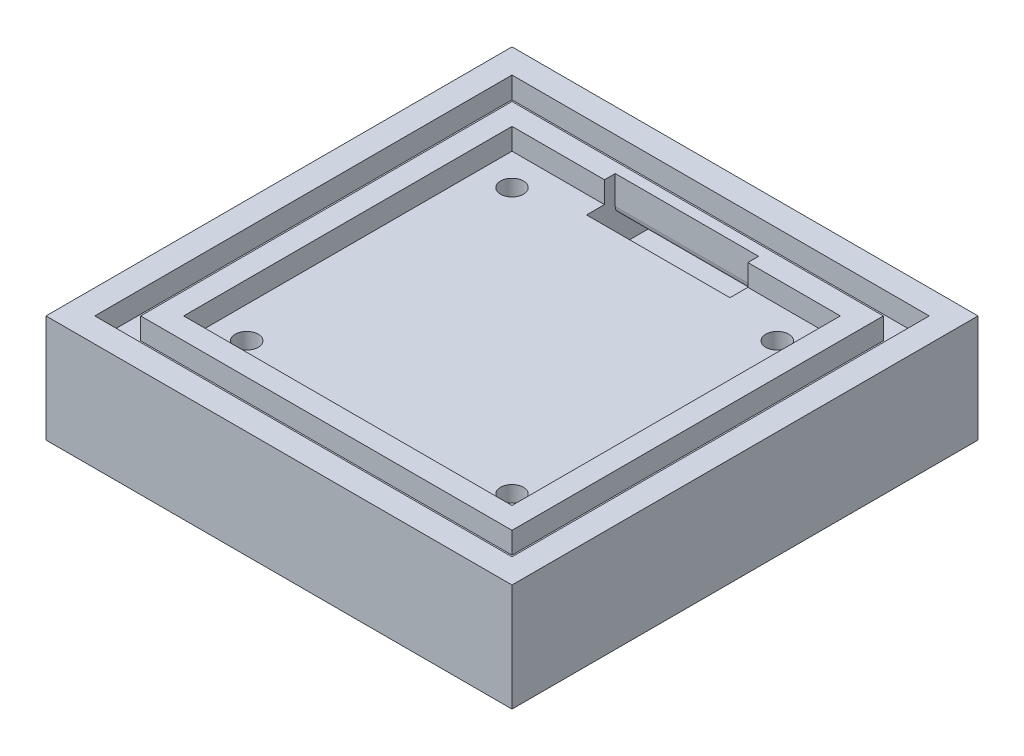
ISO-10303-21;
HEADER;
FILE_DESCRIPTION(('STEP AP214'),'2;1');
FILE_NAME('part.step','',(''),(''),'','','');
FILE_SCHEMA(('AUTOMOTIVE_DESIGN { 1 0 10303 214 1 1 1 1 }'));
ENDSEC;
DATA;
#1=APPLICATION_CONTEXT('core data for automotive mechanical design processes');
#2=APPLICATION_PROTOCOL_DEFINITION('international standard','automotive_design',2000,#1);
#3=PRODUCT_CONTEXT('',#1,'mechanical');
#4=PRODUCT('Part','Part','',(#3));
#5=PRODUCT_RELATED_PRODUCT_CATEGORY('part','',(#4));
#6=PRODUCT_DEFINITION_FORMATION('','',#4);
#7=PRODUCT_DEFINITION_CONTEXT('part definition',#1,'design');
#8=PRODUCT_DEFINITION('design','',#6,#7);
#9=PRODUCT_DEFINITION_SHAPE('','',#8);
#10=(LENGTH_UNIT() NAMED_UNIT(*) SI_UNIT(.MILLI.,.METRE.));
#11=(NAMED_UNIT(*) PLANE_ANGLE_UNIT() SI_UNIT($,.RADIAN.));
#12=(NAMED_UNIT(*) SI_UNIT($,.STERADIAN.) SOLID_ANGLE_UNIT());
#13=UNCERTAINTY_MEASURE_WITH_UNIT(LENGTH_MEASURE(1.E-05),#10,'distance_accuracy_value','');
#14=(GEOMETRIC_REPRESENTATION_CONTEXT(3) GLOBAL_UNCERTAINTY_ASSIGNED_CONTEXT((#13)) GLOBAL_UNIT_ASSIGNED_CONTEXT((#10,
#11,#12)) REPRESENTATION_CONTEXT('',''));
#15=CARTESIAN_POINT('',(0.,0.,0.));
#16=DIRECTION('',(0.,0.,1.));
#17=DIRECTION('',(1.,0.,0.));
#18=AXIS2_PLACEMENT_3D('',#15,#16,#17);
#19=CARTESIAN_POINT('',(9.59999999999999,12.,9.59999999999998));
#20=DIRECTION('',(0.,0.,-1.));
#21=DIRECTION('',(-1.,0.,0.));
#22=AXIS2_PLACEMENT_3D('',#19,#20,#21);
#23=PLANE('',#22);
#24=DIRECTION('',(-1.,0.,0.));
#25=VECTOR('',#24,1.);
#26=CARTESIAN_POINT('',(9.59999999999999,12.,9.59999999999998));
#27=LINE('',#26,#25);
#28=CARTESIAN_POINT('',(22.5,12.,9.59999999999997));
#29=VERTEX_POINT('',#28);
#30=CARTESIAN_POINT('',(9.59999999999999,12.,9.59999999999998));
#31=VERTEX_POINT('',#30);
#32=EDGE_CURVE('E364',#29,#31,#27,.T.);
#33=ORIENTED_EDGE('',*,*,#32,.F.);
#34=DIRECTION('',(0.,1.,0.));
#35=VECTOR('',#34,1.);
#36=CARTESIAN_POINT('',(22.5,12.,9.59999999999997));
#37=LINE('',#36,#35);
#38=CARTESIAN_POINT('',(22.5,15.,9.59999999999996));
#39=VERTEX_POINT('',#38);
#40=EDGE_CURVE('E443',#29,#39,#37,.T.);
#41=ORIENTED_EDGE('',*,*,#40,.T.);
#42=DIRECTION('',(-1.,0.,0.));
#43=VECTOR('',#42,1.);
#44=CARTESIAN_POINT('',(9.59999999999999,15.,9.59999999999998));
#45=LINE('',#44,#43);
#46=CARTESIAN_POINT('',(9.59999999999999,15.,9.59999999999998));
#47=VERTEX_POINT('',#46);
#48=EDGE_CURVE('E376',#39,#47,#45,.T.);
#49=ORIENTED_EDGE('',*,*,#48,.T.);
#50=DIRECTION('',(0.,1.,0.));
#51=VECTOR('',#50,1.);
#52=CARTESIAN_POINT('',(9.59999999999999,12.,9.59999999999998));
#53=LINE('',#52,#51);
#54=EDGE_CURVE('E379',#31,#47,#53,.T.);
#55=ORIENTED_EDGE('',*,*,#54,.F.);
#56=EDGE_LOOP('',(#33,#41,#49,#55));
#57=FACE_BOUND('',#56,.T.);
#58=ADVANCED_FACE('F34',(#57),#23,.F.);
#59=CARTESIAN_POINT('',(14.,15.,51.));
#60=DIRECTION('',(0.,-1.,0.));
#61=DIRECTION('',(0.,0.,-1.));
#62=AXIS2_PLACEMENT_3D('',#59,#60,#61);
#63=CYLINDRICAL_SURFACE('',#62,1.6);
#64=CARTESIAN_POINT('',(14.,12.,51.));
#65=DIRECTION('',(0.,1.,0.));
#66=DIRECTION('',(0.,0.,1.));
#67=AXIS2_PLACEMENT_3D('',#64,#65,#66);
#68=CIRCLE('',#67,1.6);
#69=CARTESIAN_POINT('',(14.,12.,52.6));
#70=VERTEX_POINT('',#69);
#71=EDGE_CURVE('E395',#70,#70,#68,.F.);
#72=ORIENTED_EDGE('',*,*,#71,.F.);
#73=EDGE_LOOP('',(#72));
#74=FACE_BOUND('',#73,.T.);
#75=CARTESIAN_POINT('',(14.,5.,51.));
#76=DIRECTION('',(0.,-1.,0.));
#77=DIRECTION('',(0.,0.,-1.));
#78=AXIS2_PLACEMENT_3D('',#75,#76,#77);
#79=CIRCLE('',#78,1.6);
#80=CARTESIAN_POINT('',(14.,5.,49.4));
#81=VERTEX_POINT('',#80);
#82=EDGE_CURVE('E305',#81,#81,#79,.F.);
#83=ORIENTED_EDGE('',*,*,#82,.F.);
#84=EDGE_LOOP('',(#83));
#85=FACE_BOUND('',#84,.T.);
#86=ADVANCED_FACE('F496',(#74,#85),#63,.F.);
#87=CARTESIAN_POINT('',(51.,15.,14.));
#88=DIRECTION('',(0.,-1.,0.));
#89=DIRECTION('',(0.,0.,-1.));
#90=AXIS2_PLACEMENT_3D('',#87,#88,#89);
#91=CYLINDRICAL_SURFACE('',#90,1.6);
#92=CARTESIAN_POINT('',(51.,12.,14.));
#93=DIRECTION('',(0.,1.,0.));
#94=DIRECTION('',(0.,0.,1.));
#95=AXIS2_PLACEMENT_3D('',#92,#93,#94);
#96=CIRCLE('',#95,1.6);
#97=CARTESIAN_POINT('',(51.,12.,15.6));
#98=VERTEX_POINT('',#97);
#99=EDGE_CURVE('E392',#98,#98,#96,.F.);
#100=ORIENTED_EDGE('',*,*,#99,.F.);
#101=EDGE_LOOP('',(#100));
#102=FACE_BOUND('',#101,.T.);
#103=CARTESIAN_POINT('',(51.,5.,14.));
#104=DIRECTION('',(0.,-1.,0.));
#105=DIRECTION('',(0.,0.,-1.));
#106=AXIS2_PLACEMENT_3D('',#103,#104,#105);
#107=CIRCLE('',#106,1.6);
#108=CARTESIAN_POINT('',(51.,5.,12.4));
#109=VERTEX_POINT('',#108);
#110=EDGE_CURVE('E436',#109,#109,#107,.F.);
#111=ORIENTED_EDGE('',*,*,#110,.F.);
#112=EDGE_LOOP('',(#111));
#113=FACE_BOUND('',#112,.T.);
#114=ADVANCED_FACE('F502',(#102,#113),#91,.F.);
#115=CARTESIAN_POINT('',(14.,15.,14.));
#116=DIRECTION('',(0.,-1.,0.));
#117=DIRECTION('',(0.,0.,-1.));
#118=AXIS2_PLACEMENT_3D('',#115,#116,#117);
#119=CYLINDRICAL_SURFACE('',#118,1.6);
#120=CARTESIAN_POINT('',(14.,12.,14.));
#121=DIRECTION('',(0.,1.,0.));
#122=DIRECTION('',(0.,0.,1.));
#123=AXIS2_PLACEMENT_3D('',#120,#121,#122);
#124=CIRCLE('',#123,1.6);
#125=CARTESIAN_POINT('',(14.,12.,15.6));
#126=VERTEX_POINT('',#125);
#127=EDGE_CURVE('E389',#126,#126,#124,.F.);
#128=ORIENTED_EDGE('',*,*,#127,.F.);
#129=EDGE_LOOP('',(#128));
#130=FACE_BOUND('',#129,.T.);
#131=CARTESIAN_POINT('',(14.,5.,14.));
#132=DIRECTION('',(0.,-1.,0.));
#133=DIRECTION('',(0.,0.,-1.));
#134=AXIS2_PLACEMENT_3D('',#131,#132,#133);
#135=CIRCLE('',#134,1.6);
#136=CARTESIAN_POINT('',(14.,5.,12.4));
#137=VERTEX_POINT('',#136);
#138=EDGE_CURVE('E433',#137,#137,#135,.F.);
#139=ORIENTED_EDGE('',*,*,#138,.F.);
#140=EDGE_LOOP('',(#139));
#141=FACE_BOUND('',#140,.T.);
#142=ADVANCED_FACE('F653',(#130,#141),#119,.F.);
#143=CARTESIAN_POINT('',(51.,15.,51.));
#144=DIRECTION('',(0.,-1.,0.));
#145=DIRECTION('',(0.,0.,-1.));
#146=AXIS2_PLACEMENT_3D('',#143,#144,#145);
#147=CYLINDRICAL_SURFACE('',#146,1.6);
#148=CARTESIAN_POINT('',(51.,12.,51.));
#149=DIRECTION('',(0.,1.,0.));
#150=DIRECTION('',(0.,0.,1.));
#151=AXIS2_PLACEMENT_3D('',#148,#149,#150);
#152=CIRCLE('',#151,1.6);
#153=CARTESIAN_POINT('',(51.,12.,52.6));
#154=VERTEX_POINT('',#153);
#155=EDGE_CURVE('E382',#154,#154,#152,.F.);
#156=ORIENTED_EDGE('',*,*,#155,.F.);
#157=EDGE_LOOP('',(#156));
#158=FACE_BOUND('',#157,.T.);
#159=CARTESIAN_POINT('',(51.,5.,51.));
#160=DIRECTION('',(0.,-1.,0.));
#161=DIRECTION('',(0.,0.,-1.));
#162=AXIS2_PLACEMENT_3D('',#159,#160,#161);
#163=CIRCLE('',#162,1.6);
#164=CARTESIAN_POINT('',(51.,5.,49.4));
#165=VERTEX_POINT('',#164);
#166=EDGE_CURVE('E284',#165,#165,#163,.F.);
#167=ORIENTED_EDGE('',*,*,#166,.F.);
#168=EDGE_LOOP('',(#167));
#169=FACE_BOUND('',#168,.T.);
#170=ADVANCED_FACE('F637',(#158,#169),#147,.F.);
#171=CARTESIAN_POINT('',(0.,15.,0.));
#172=DIRECTION('',(0.,1.,0.));
#173=DIRECTION('',(0.,0.,1.));
#174=AXIS2_PLACEMENT_3D('',#171,#172,#173);
#175=PLANE('',#174);
#176=DIRECTION('',(0.,0.,1.));
#177=VECTOR('',#176,1.);
#178=CARTESIAN_POINT('',(22.5,15.,8.09999999999993));
#179=LINE('',#178,#177);
#180=CARTESIAN_POINT('',(22.5,15.,8.09999999999993));
#181=VERTEX_POINT('',#180);
#182=EDGE_CURVE('E240',#181,#39,#179,.T.);
#183=ORIENTED_EDGE('',*,*,#182,.F.);
#184=DIRECTION('',(-1.,0.,0.));
#185=VECTOR('',#184,1.);
#186=CARTESIAN_POINT('',(22.5,15.,8.09999999999993));
#187=LINE('',#186,#185);
#188=CARTESIAN_POINT('',(42.5,15.,8.09999999999993));
#189=VERTEX_POINT('',#188);
#190=EDGE_CURVE('E218',#189,#181,#187,.T.);
#191=ORIENTED_EDGE('',*,*,#190,.F.);
#192=DIRECTION('',(0.,0.,-1.));
#193=VECTOR('',#192,1.);
#194=CARTESIAN_POINT('',(42.5,15.,8.09999999999993));
#195=LINE('',#194,#193);
#196=CARTESIAN_POINT('',(42.5,15.,9.59999999999996));
#197=VERTEX_POINT('',#196);
#198=EDGE_CURVE('E245',#197,#189,#195,.T.);
#199=ORIENTED_EDGE('',*,*,#198,.F.);
#200=CARTESIAN_POINT('',(55.4,15.,9.59999999999994));
#201=VERTEX_POINT('',#200);
#202=EDGE_CURVE('E358',#201,#197,#45,.T.);
#203=ORIENTED_EDGE('',*,*,#202,.F.);
#204=DIRECTION('',(0.,0.,-1.));
#205=VECTOR('',#204,1.);
#206=CARTESIAN_POINT('',(55.4,15.,9.59999999999994));
#207=LINE('',#206,#205);
#208=CARTESIAN_POINT('',(55.4000000000001,15.,55.3999999999999));
#209=VERTEX_POINT('',#208);
#210=EDGE_CURVE('E373',#209,#201,#207,.T.);
#211=ORIENTED_EDGE('',*,*,#210,.F.);
#212=DIRECTION('',(1.,0.,0.));
#213=VECTOR('',#212,1.);
#214=CARTESIAN_POINT('',(9.60000000000004,15.,55.4));
#215=LINE('',#214,#213);
#216=CARTESIAN_POINT('',(9.60000000000004,15.,55.4));
#217=VERTEX_POINT('',#216);
#218=EDGE_CURVE('E370',#217,#209,#215,.T.);
#219=ORIENTED_EDGE('',*,*,#218,.F.);
#220=DIRECTION('',(0.,0.,1.));
#221=VECTOR('',#220,1.);
#222=CARTESIAN_POINT('',(9.59999999999999,15.,9.59999999999998));
#223=LINE('',#222,#221);
#224=EDGE_CURVE('E347',#47,#217,#223,.T.);
#225=ORIENTED_EDGE('',*,*,#224,.F.);
#226=ORIENTED_EDGE('',*,*,#48,.F.);
#227=EDGE_LOOP('',(#183,#191,#199,#203,#211,#219,#225,#226));
#228=FACE_BOUND('',#227,.T.);
#229=DIRECTION('',(1.,0.,0.));
#230=VECTOR('',#229,1.);
#231=CARTESIAN_POINT('',(58.4000000000001,15.,58.3999999999999));
#232=LINE('',#231,#230);
#233=CARTESIAN_POINT('',(6.60000000000003,15.,58.4));
#234=VERTEX_POINT('',#233);
#235=CARTESIAN_POINT('',(58.4000000000001,15.,58.3999999999999));
#236=VERTEX_POINT('',#235);
#237=EDGE_CURVE('E291',#234,#236,#232,.T.);
#238=ORIENTED_EDGE('',*,*,#237,.T.);
#239=DIRECTION('',(0.,0.,-1.));
#240=VECTOR('',#239,1.);
#241=CARTESIAN_POINT('',(58.4,15.,6.59999999999993));
#242=LINE('',#241,#240);
#243=CARTESIAN_POINT('',(58.4,15.,6.59999999999993));
#244=VERTEX_POINT('',#243);
#245=EDGE_CURVE('E301',#236,#244,#242,.T.);
#246=ORIENTED_EDGE('',*,*,#245,.T.);
#247=DIRECTION('',(-1.,0.,0.));
#248=VECTOR('',#247,1.);
#249=CARTESIAN_POINT('',(58.4,15.,6.59999999999993));
#250=LINE('',#249,#248);
#251=CARTESIAN_POINT('',(6.59999999999997,15.,6.59999999999999));
#252=VERTEX_POINT('',#251);
#253=EDGE_CURVE('E304',#244,#252,#250,.T.);
#254=ORIENTED_EDGE('',*,*,#253,.T.);
#255=DIRECTION('',(0.,0.,1.));
#256=VECTOR('',#255,1.);
#257=CARTESIAN_POINT('',(6.59999999999997,15.,6.59999999999999));
#258=LINE('',#257,#256);
#259=EDGE_CURVE('E308',#252,#234,#258,.T.);
#260=ORIENTED_EDGE('',*,*,#259,.T.);
#261=EDGE_LOOP('',(#238,#246,#254,#260));
#262=FACE_BOUND('',#261,.T.);
#263=ADVANCED_FACE('F471',(#228,#262),#175,.T.);
#264=CARTESIAN_POINT('',(0.,15.,0.));
#265=DIRECTION('',(1.,0.,0.));
#266=DIRECTION('',(0.,0.,-1.));
#267=AXIS2_PLACEMENT_3D('',#264,#265,#266);
#268=PLANE('',#267);
#269=DIRECTION('',(0.,0.,1.));
#270=VECTOR('',#269,1.);
#271=CARTESIAN_POINT('',(0.,0.,0.));
#272=LINE('',#271,#270);
#273=CARTESIAN_POINT('',(0.,0.,0.));
#274=VERTEX_POINT('',#273);
#275=CARTESIAN_POINT('',(0.,0.,65.));
#276=VERTEX_POINT('',#275);
#277=EDGE_CURVE('E398',#274,#276,#272,.T.);
#278=ORIENTED_EDGE('',*,*,#277,.T.);
#279=DIRECTION('',(0.,-1.,0.));
#280=VECTOR('',#279,1.);
#281=CARTESIAN_POINT('',(0.,15.,65.));
#282=LINE('',#281,#280);
#283=CARTESIAN_POINT('',(0.,15.,65.));
#284=VERTEX_POINT('',#283);
#285=EDGE_CURVE('E425',#284,#276,#282,.T.);
#286=ORIENTED_EDGE('',*,*,#285,.F.);
#287=DIRECTION('',(0.,0.,1.));
#288=VECTOR('',#287,1.);
#289=CARTESIAN_POINT('',(0.,15.,0.));
#290=LINE('',#289,#288);
#291=CARTESIAN_POINT('',(0.,15.,0.));
#292=VERTEX_POINT('',#291);
#293=EDGE_CURVE('E399',#292,#284,#290,.T.);
#294=ORIENTED_EDGE('',*,*,#293,.F.);
#295=DIRECTION('',(0.,-1.,0.));
#296=VECTOR('',#295,1.);
#297=CARTESIAN_POINT('',(0.,15.,0.));
#298=LINE('',#297,#296);
#299=EDGE_CURVE('E409',#292,#274,#298,.T.);
#300=ORIENTED_EDGE('',*,*,#299,.T.);
#301=EDGE_LOOP('',(#278,#286,#294,#300));
#302=FACE_BOUND('',#301,.T.);
#303=ADVANCED_FACE('F630',(#302),#268,.F.);
#304=CARTESIAN_POINT('',(0.,15.,65.));
#305=DIRECTION('',(0.,0.,-1.));
#306=DIRECTION('',(-1.,0.,0.));
#307=AXIS2_PLACEMENT_3D('',#304,#305,#306);
#308=PLANE('',#307);
#309=DIRECTION('',(1.,0.,0.));
#310=VECTOR('',#309,1.);
#311=CARTESIAN_POINT('',(0.,0.,65.));
#312=LINE('',#311,#310);
#313=CARTESIAN_POINT('',(65.,0.,65.));
#314=VERTEX_POINT('',#313);
#315=EDGE_CURVE('E412',#276,#314,#312,.T.);
#316=ORIENTED_EDGE('',*,*,#315,.T.);
#317=DIRECTION('',(0.,-1.,0.));
#318=VECTOR('',#317,1.);
#319=CARTESIAN_POINT('',(65.,15.,65.));
#320=LINE('',#319,#318);
#321=CARTESIAN_POINT('',(65.,15.,65.));
#322=VERTEX_POINT('',#321);
#323=EDGE_CURVE('E422',#322,#314,#320,.T.);
#324=ORIENTED_EDGE('',*,*,#323,.F.);
#325=DIRECTION('',(1.,0.,0.));
#326=VECTOR('',#325,1.);
#327=CARTESIAN_POINT('',(0.,15.,65.));
#328=LINE('',#327,#326);
#329=EDGE_CURVE('E402',#284,#322,#328,.T.);
#330=ORIENTED_EDGE('',*,*,#329,.F.);
#331=ORIENTED_EDGE('',*,*,#285,.T.);
#332=EDGE_LOOP('',(#316,#324,#330,#331));
#333=FACE_BOUND('',#332,.T.);
#334=ADVANCED_FACE('F626',(#333),#308,.F.);
#335=CARTESIAN_POINT('',(65.,15.,0.));
#336=DIRECTION('',(-1.,0.,0.));
#337=DIRECTION('',(0.,0.,1.));
#338=AXIS2_PLACEMENT_3D('',#335,#336,#337);
#339=PLANE('',#338);
#340=DIRECTION('',(0.,0.,-1.));
#341=VECTOR('',#340,1.);
#342=CARTESIAN_POINT('',(65.,0.,0.));
#343=LINE('',#342,#341);
#344=CARTESIAN_POINT('',(65.,0.,0.));
#345=VERTEX_POINT('',#344);
#346=EDGE_CURVE('E414',#314,#345,#343,.T.);
#347=ORIENTED_EDGE('',*,*,#346,.T.);
#348=DIRECTION('',(0.,-1.,0.));
#349=VECTOR('',#348,1.);
#350=CARTESIAN_POINT('',(65.,15.,0.));
#351=LINE('',#350,#349);
#352=CARTESIAN_POINT('',(65.,15.,0.));
#353=VERTEX_POINT('',#352);
#354=EDGE_CURVE('E419',#353,#345,#351,.T.);
#355=ORIENTED_EDGE('',*,*,#354,.F.);
#356=DIRECTION('',(0.,0.,-1.));
#357=VECTOR('',#356,1.);
#358=CARTESIAN_POINT('',(65.,15.,0.));
#359=LINE('',#358,#357);
#360=EDGE_CURVE('E405',#322,#353,#359,.T.);
#361=ORIENTED_EDGE('',*,*,#360,.F.);
#362=ORIENTED_EDGE('',*,*,#323,.T.);
#363=EDGE_LOOP('',(#347,#355,#361,#362));
#364=FACE_BOUND('',#363,.T.);
#365=ADVANCED_FACE('F623',(#364),#339,.F.);
#366=CARTESIAN_POINT('',(0.,15.,0.));
#367=DIRECTION('',(0.,0.,1.));
#368=DIRECTION('',(1.,0.,0.));
#369=AXIS2_PLACEMENT_3D('',#366,#367,#368);
#370=PLANE('',#369);
#371=DIRECTION('',(-1.,0.,0.));
#372=VECTOR('',#371,1.);
#373=CARTESIAN_POINT('',(42.5,6.00000000000001,0.));
#374=LINE('',#373,#372);
#375=CARTESIAN_POINT('',(42.5,6.00000000000001,0.));
#376=VERTEX_POINT('',#375);
#377=CARTESIAN_POINT('',(22.5,6.00000000000001,0.));
#378=VERTEX_POINT('',#377);
#379=EDGE_CURVE('E221',#376,#378,#374,.T.);
#380=ORIENTED_EDGE('',*,*,#379,.F.);
#381=DIRECTION('',(0.,-1.,0.));
#382=VECTOR('',#381,1.);
#383=CARTESIAN_POINT('',(42.5,6.00000000000001,0.));
#384=LINE('',#383,#382);
#385=CARTESIAN_POINT('',(42.5,10.,0.));
#386=VERTEX_POINT('',#385);
#387=EDGE_CURVE('E227',#386,#376,#384,.T.);
#388=ORIENTED_EDGE('',*,*,#387,.F.);
#389=DIRECTION('',(1.,0.,0.));
#390=VECTOR('',#389,1.);
#391=CARTESIAN_POINT('',(42.5,10.,0.));
#392=LINE('',#391,#390);
#393=CARTESIAN_POINT('',(22.5,10.,0.));
#394=VERTEX_POINT('',#393);
#395=EDGE_CURVE('E232',#394,#386,#392,.T.);
#396=ORIENTED_EDGE('',*,*,#395,.F.);
#397=DIRECTION('',(0.,1.,0.));
#398=VECTOR('',#397,1.);
#399=CARTESIAN_POINT('',(22.5,6.00000000000001,0.));
#400=LINE('',#399,#398);
#401=EDGE_CURVE('E210',#378,#394,#400,.T.);
#402=ORIENTED_EDGE('',*,*,#401,.F.);
#403=EDGE_LOOP('',(#380,#388,#396,#402));
#404=FACE_BOUND('',#403,.T.);
#405=DIRECTION('',(-1.,0.,0.));
#406=VECTOR('',#405,1.);
#407=CARTESIAN_POINT('',(0.,0.,0.));
#408=LINE('',#407,#406);
#409=EDGE_CURVE('E403',#345,#274,#408,.T.);
#410=ORIENTED_EDGE('',*,*,#409,.T.);
#411=ORIENTED_EDGE('',*,*,#299,.F.);
#412=DIRECTION('',(-1.,0.,0.));
#413=VECTOR('',#412,1.);
#414=CARTESIAN_POINT('',(0.,15.,0.));
#415=LINE('',#414,#413);
#416=EDGE_CURVE('E407',#353,#292,#415,.T.);
#417=ORIENTED_EDGE('',*,*,#416,.F.);
#418=ORIENTED_EDGE('',*,*,#354,.T.);
#419=EDGE_LOOP('',(#410,#411,#417,#418));
#420=FACE_BOUND('',#419,.T.);
#421=ADVANCED_FACE('F229',(#404,#420),#370,.F.);
#422=DIRECTION('',(-1.,0.,0.));
#423=VECTOR('',#422,1.);
#424=CARTESIAN_POINT('',(61.5999999999999,15.,3.40000000000007));
#425=LINE('',#424,#423);
#426=CARTESIAN_POINT('',(61.5999999999999,15.,3.40000000000007));
#427=VERTEX_POINT('',#426);
#428=CARTESIAN_POINT('',(3.40000000000009,15.,3.40000000000008));
#429=VERTEX_POINT('',#428);
#430=EDGE_CURVE('E315',#427,#429,#425,.T.);
#431=ORIENTED_EDGE('',*,*,#430,.F.);
#432=DIRECTION('',(0.,0.,-1.));
#433=VECTOR('',#432,1.);
#434=CARTESIAN_POINT('',(61.5999999999999,15.,3.40000000000007));
#435=LINE('',#434,#433);
#436=CARTESIAN_POINT('',(61.5999999999999,15.,61.5999999999999));
#437=VERTEX_POINT('',#436);
#438=EDGE_CURVE('E326',#437,#427,#435,.T.);
#439=ORIENTED_EDGE('',*,*,#438,.F.);
#440=DIRECTION('',(1.,0.,0.));
#441=VECTOR('',#440,1.);
#442=CARTESIAN_POINT('',(61.5999999999999,15.,61.5999999999999));
#443=LINE('',#442,#441);
#444=CARTESIAN_POINT('',(3.4000000000001,15.,61.5999999999999));
#445=VERTEX_POINT('',#444);
#446=EDGE_CURVE('E340',#445,#437,#443,.T.);
#447=ORIENTED_EDGE('',*,*,#446,.F.);
#448=DIRECTION('',(0.,0.,1.));
#449=VECTOR('',#448,1.);
#450=CARTESIAN_POINT('',(3.40000000000009,15.,3.40000000000008));
#451=LINE('',#450,#449);
#452=EDGE_CURVE('E337',#429,#445,#451,.T.);
#453=ORIENTED_EDGE('',*,*,#452,.F.);
#454=EDGE_LOOP('',(#431,#439,#447,#453));
#455=FACE_BOUND('',#454,.T.);
#456=ORIENTED_EDGE('',*,*,#293,.T.);
#457=ORIENTED_EDGE('',*,*,#329,.T.);
#458=ORIENTED_EDGE('',*,*,#360,.T.);
#459=ORIENTED_EDGE('',*,*,#416,.T.);
#460=EDGE_LOOP('',(#456,#457,#458,#459));
#461=FACE_BOUND('',#460,.T.);
#462=ADVANCED_FACE('F610',(#455,#461),#175,.T.);
#463=CARTESIAN_POINT('',(0.,0.,0.));
#464=DIRECTION('',(0.,1.,0.));
#465=DIRECTION('',(0.,0.,1.));
#466=AXIS2_PLACEMENT_3D('',#463,#464,#465);
#467=PLANE('',#466);
#468=CARTESIAN_POINT('',(14.,0.,51.));
#469=DIRECTION('',(0.,-1.,0.));
#470=DIRECTION('',(0.,0.,-1.));
#471=AXIS2_PLACEMENT_3D('',#468,#469,#470);
#472=CIRCLE('',#471,3.);
#473=CARTESIAN_POINT('',(14.,0.,48.));
#474=VERTEX_POINT('',#473);
#475=EDGE_CURVE('E273',#474,#474,#472,.T.);
#476=ORIENTED_EDGE('',*,*,#475,.F.);
#477=EDGE_LOOP('',(#476));
#478=FACE_BOUND('',#477,.T.);
#479=CARTESIAN_POINT('',(51.,0.,14.));
#480=DIRECTION('',(0.,-1.,0.));
#481=DIRECTION('',(0.,0.,-1.));
#482=AXIS2_PLACEMENT_3D('',#479,#480,#481);
#483=CIRCLE('',#482,3.);
#484=CARTESIAN_POINT('',(51.,0.,11.));
#485=VERTEX_POINT('',#484);
#486=EDGE_CURVE('E266',#485,#485,#483,.T.);
#487=ORIENTED_EDGE('',*,*,#486,.F.);
#488=EDGE_LOOP('',(#487));
#489=FACE_BOUND('',#488,.T.);
#490=CARTESIAN_POINT('',(51.,0.,51.));
#491=DIRECTION('',(0.,-1.,0.));
#492=DIRECTION('',(0.,0.,-1.));
#493=AXIS2_PLACEMENT_3D('',#490,#491,#492);
#494=CIRCLE('',#493,3.);
#495=CARTESIAN_POINT('',(51.,0.,48.));
#496=VERTEX_POINT('',#495);
#497=EDGE_CURVE('E262',#496,#496,#494,.T.);
#498=ORIENTED_EDGE('',*,*,#497,.F.);
#499=EDGE_LOOP('',(#498));
#500=FACE_BOUND('',#499,.T.);
#501=CARTESIAN_POINT('',(14.,0.,14.));
#502=DIRECTION('',(0.,-1.,0.));
#503=DIRECTION('',(0.,0.,-1.));
#504=AXIS2_PLACEMENT_3D('',#501,#502,#503);
#505=CIRCLE('',#504,3.);
#506=CARTESIAN_POINT('',(14.,0.,11.));
#507=VERTEX_POINT('',#506);
#508=EDGE_CURVE('E272',#507,#507,#505,.T.);
#509=ORIENTED_EDGE('',*,*,#508,.F.);
#510=EDGE_LOOP('',(#509));
#511=FACE_BOUND('',#510,.T.);
#512=ORIENTED_EDGE('',*,*,#277,.F.);
#513=ORIENTED_EDGE('',*,*,#409,.F.);
#514=ORIENTED_EDGE('',*,*,#346,.F.);
#515=ORIENTED_EDGE('',*,*,#315,.F.);
#516=EDGE_LOOP('',(#512,#513,#514,#515));
#517=FACE_BOUND('',#516,.T.);
#518=ADVANCED_FACE('F606',(#478,#489,#500,#511,#517),#467,.F.);
#519=CARTESIAN_POINT('',(0.,12.,0.));
#520=DIRECTION('',(0.,1.,0.));
#521=DIRECTION('',(0.,0.,1.));
#522=AXIS2_PLACEMENT_3D('',#519,#520,#521);
#523=PLANE('',#522);
#524=DIRECTION('',(0.,0.,1.));
#525=VECTOR('',#524,1.);
#526=CARTESIAN_POINT('',(22.5,12.,0.));
#527=LINE('',#526,#525);
#528=CARTESIAN_POINT('',(22.5,12.,12.0999999999999));
#529=VERTEX_POINT('',#528);
#530=EDGE_CURVE('E259',#29,#529,#527,.T.);
#531=ORIENTED_EDGE('',*,*,#530,.F.);
#532=ORIENTED_EDGE('',*,*,#32,.T.);
#533=DIRECTION('',(0.,0.,1.));
#534=VECTOR('',#533,1.);
#535=CARTESIAN_POINT('',(9.59999999999999,12.,9.59999999999998));
#536=LINE('',#535,#534);
#537=CARTESIAN_POINT('',(9.60000000000004,12.,55.4));
#538=VERTEX_POINT('',#537);
#539=EDGE_CURVE('E354',#31,#538,#536,.T.);
#540=ORIENTED_EDGE('',*,*,#539,.T.);
#541=DIRECTION('',(1.,0.,0.));
#542=VECTOR('',#541,1.);
#543=CARTESIAN_POINT('',(9.60000000000004,12.,55.4));
#544=LINE('',#543,#542);
#545=CARTESIAN_POINT('',(55.4000000000001,12.,55.3999999999999));
#546=VERTEX_POINT('',#545);
#547=EDGE_CURVE('E357',#538,#546,#544,.T.);
#548=ORIENTED_EDGE('',*,*,#547,.T.);
#549=DIRECTION('',(0.,0.,-1.));
#550=VECTOR('',#549,1.);
#551=CARTESIAN_POINT('',(55.4,12.,9.59999999999994));
#552=LINE('',#551,#550);
#553=CARTESIAN_POINT('',(55.4,12.,9.59999999999994));
#554=VERTEX_POINT('',#553);
#555=EDGE_CURVE('E361',#546,#554,#552,.T.);
#556=ORIENTED_EDGE('',*,*,#555,.T.);
#557=CARTESIAN_POINT('',(42.5,12.,9.59999999999995));
#558=VERTEX_POINT('',#557);
#559=EDGE_CURVE('E365',#554,#558,#27,.T.);
#560=ORIENTED_EDGE('',*,*,#559,.T.);
#561=DIRECTION('',(0.,0.,-1.));
#562=VECTOR('',#561,1.);
#563=CARTESIAN_POINT('',(42.5,12.,0.));
#564=LINE('',#563,#562);
#565=CARTESIAN_POINT('',(42.5,12.,12.0999999999999));
#566=VERTEX_POINT('',#565);
#567=EDGE_CURVE('E252',#566,#558,#564,.T.);
#568=ORIENTED_EDGE('',*,*,#567,.F.);
#569=DIRECTION('',(1.,0.,0.));
#570=VECTOR('',#569,1.);
#571=CARTESIAN_POINT('',(0.,12.,12.0999999999999));
#572=LINE('',#571,#570);
#573=EDGE_CURVE('E446',#529,#566,#572,.T.);
#574=ORIENTED_EDGE('',*,*,#573,.F.);
#575=EDGE_LOOP('',(#531,#532,#540,#548,#556,#560,#568,#574));
#576=FACE_BOUND('',#575,.T.);
#577=ORIENTED_EDGE('',*,*,#155,.T.);
#578=EDGE_LOOP('',(#577));
#579=FACE_BOUND('',#578,.T.);
#580=ORIENTED_EDGE('',*,*,#127,.T.);
#581=EDGE_LOOP('',(#580));
#582=FACE_BOUND('',#581,.T.);
#583=ORIENTED_EDGE('',*,*,#99,.T.);
#584=EDGE_LOOP('',(#583));
#585=FACE_BOUND('',#584,.T.);
#586=ORIENTED_EDGE('',*,*,#71,.T.);
#587=EDGE_LOOP('',(#586));
#588=FACE_BOUND('',#587,.T.);
#589=ADVANCED_FACE('F481',(#576,#579,#582,#585,#588),#523,.T.);
#590=CARTESIAN_POINT('',(9.59999999999999,12.,9.59999999999998));
#591=DIRECTION('',(-1.,0.,0.));
#592=DIRECTION('',(0.,0.,1.));
#593=AXIS2_PLACEMENT_3D('',#590,#591,#592);
#594=PLANE('',#593);
#595=ORIENTED_EDGE('',*,*,#224,.T.);
#596=DIRECTION('',(0.,1.,0.));
#597=VECTOR('',#596,1.);
#598=CARTESIAN_POINT('',(9.60000000000004,12.,55.4));
#599=LINE('',#598,#597);
#600=EDGE_CURVE('E368',#538,#217,#599,.T.);
#601=ORIENTED_EDGE('',*,*,#600,.F.);
#602=ORIENTED_EDGE('',*,*,#539,.F.);
#603=ORIENTED_EDGE('',*,*,#54,.T.);
#604=EDGE_LOOP('',(#595,#601,#602,#603));
#605=FACE_BOUND('',#604,.T.);
#606=ADVANCED_FACE('F509',(#605),#594,.F.);
#607=ORIENTED_EDGE('',*,*,#202,.T.);
#608=DIRECTION('',(0.,-1.,0.));
#609=VECTOR('',#608,1.);
#610=CARTESIAN_POINT('',(42.5,12.,9.59999999999995));
#611=LINE('',#610,#609);
#612=EDGE_CURVE('E428',#197,#558,#611,.T.);
#613=ORIENTED_EDGE('',*,*,#612,.T.);
#614=ORIENTED_EDGE('',*,*,#559,.F.);
#615=DIRECTION('',(0.,1.,0.));
#616=VECTOR('',#615,1.);
#617=CARTESIAN_POINT('',(55.4,12.,9.59999999999994));
#618=LINE('',#617,#616);
#619=EDGE_CURVE('E383',#554,#201,#618,.T.);
#620=ORIENTED_EDGE('',*,*,#619,.T.);
#621=EDGE_LOOP('',(#607,#613,#614,#620));
#622=FACE_BOUND('',#621,.T.);
#623=ADVANCED_FACE('F498',(#622),#23,.F.);
#624=CARTESIAN_POINT('',(55.4,12.,9.59999999999994));
#625=DIRECTION('',(1.,0.,0.));
#626=DIRECTION('',(0.,0.,-1.));
#627=AXIS2_PLACEMENT_3D('',#624,#625,#626);
#628=PLANE('',#627);
#629=ORIENTED_EDGE('',*,*,#210,.T.);
#630=ORIENTED_EDGE('',*,*,#619,.F.);
#631=ORIENTED_EDGE('',*,*,#555,.F.);
#632=DIRECTION('',(0.,1.,0.));
#633=VECTOR('',#632,1.);
#634=CARTESIAN_POINT('',(55.4000000000001,12.,55.3999999999999));
#635=LINE('',#634,#633);
#636=EDGE_CURVE('E385',#546,#209,#635,.T.);
#637=ORIENTED_EDGE('',*,*,#636,.T.);
#638=EDGE_LOOP('',(#629,#630,#631,#637));
#639=FACE_BOUND('',#638,.T.);
#640=ADVANCED_FACE('F508',(#639),#628,.F.);
#641=CARTESIAN_POINT('',(9.60000000000004,12.,55.4));
#642=DIRECTION('',(0.,0.,1.));
#643=DIRECTION('',(1.,0.,0.));
#644=AXIS2_PLACEMENT_3D('',#641,#642,#643);
#645=PLANE('',#644);
#646=ORIENTED_EDGE('',*,*,#218,.T.);
#647=ORIENTED_EDGE('',*,*,#636,.F.);
#648=ORIENTED_EDGE('',*,*,#547,.F.);
#649=ORIENTED_EDGE('',*,*,#600,.T.);
#650=EDGE_LOOP('',(#646,#647,#648,#649));
#651=FACE_BOUND('',#650,.T.);
#652=ADVANCED_FACE('F515',(#651),#645,.F.);
#653=CARTESIAN_POINT('',(61.5999999999999,12.,3.40000000000007));
#654=DIRECTION('',(0.,0.,-1.));
#655=DIRECTION('',(-1.,0.,0.));
#656=AXIS2_PLACEMENT_3D('',#653,#654,#655);
#657=PLANE('',#656);
#658=ORIENTED_EDGE('',*,*,#430,.T.);
#659=DIRECTION('',(0.,1.,0.));
#660=VECTOR('',#659,1.);
#661=CARTESIAN_POINT('',(3.40000000000009,12.,3.40000000000008));
#662=LINE('',#661,#660);
#663=CARTESIAN_POINT('',(3.40000000000009,12.,3.40000000000008));
#664=VERTEX_POINT('',#663);
#665=EDGE_CURVE('E335',#664,#429,#662,.T.);
#666=ORIENTED_EDGE('',*,*,#665,.F.);
#667=DIRECTION('',(-1.,0.,0.));
#668=VECTOR('',#667,1.);
#669=CARTESIAN_POINT('',(61.5999999999999,12.,3.40000000000007));
#670=LINE('',#669,#668);
#671=CARTESIAN_POINT('',(61.5999999999999,12.,3.40000000000007));
#672=VERTEX_POINT('',#671);
#673=EDGE_CURVE('E322',#672,#664,#670,.T.);
#674=ORIENTED_EDGE('',*,*,#673,.F.);
#675=DIRECTION('',(0.,1.,0.));
#676=VECTOR('',#675,1.);
#677=CARTESIAN_POINT('',(61.5999999999999,12.,3.40000000000007));
#678=LINE('',#677,#676);
#679=EDGE_CURVE('E345',#672,#427,#678,.T.);
#680=ORIENTED_EDGE('',*,*,#679,.T.);
#681=EDGE_LOOP('',(#658,#666,#674,#680));
#682=FACE_BOUND('',#681,.T.);
#683=ADVANCED_FACE('F595',(#682),#657,.F.);
#684=CARTESIAN_POINT('',(61.5999999999999,12.,3.40000000000007));
#685=DIRECTION('',(1.,0.,0.));
#686=DIRECTION('',(0.,0.,-1.));
#687=AXIS2_PLACEMENT_3D('',#684,#685,#686);
#688=PLANE('',#687);
#689=ORIENTED_EDGE('',*,*,#438,.T.);
#690=ORIENTED_EDGE('',*,*,#679,.F.);
#691=DIRECTION('',(0.,0.,-1.));
#692=VECTOR('',#691,1.);
#693=CARTESIAN_POINT('',(61.5999999999999,12.,3.40000000000007));
#694=LINE('',#693,#692);
#695=CARTESIAN_POINT('',(61.5999999999999,12.,61.5999999999999));
#696=VERTEX_POINT('',#695);
#697=EDGE_CURVE('E332',#696,#672,#694,.T.);
#698=ORIENTED_EDGE('',*,*,#697,.F.);
#699=DIRECTION('',(0.,1.,0.));
#700=VECTOR('',#699,1.);
#701=CARTESIAN_POINT('',(61.5999999999999,12.,61.5999999999999));
#702=LINE('',#701,#700);
#703=EDGE_CURVE('E348',#696,#437,#702,.T.);
#704=ORIENTED_EDGE('',*,*,#703,.T.);
#705=EDGE_LOOP('',(#689,#690,#698,#704));
#706=FACE_BOUND('',#705,.T.);
#707=ADVANCED_FACE('F591',(#706),#688,.F.);
#708=CARTESIAN_POINT('',(61.5999999999999,12.,61.5999999999999));
#709=DIRECTION('',(0.,0.,1.));
#710=DIRECTION('',(1.,0.,0.));
#711=AXIS2_PLACEMENT_3D('',#708,#709,#710);
#712=PLANE('',#711);
#713=ORIENTED_EDGE('',*,*,#446,.T.);
#714=ORIENTED_EDGE('',*,*,#703,.F.);
#715=DIRECTION('',(1.,0.,0.));
#716=VECTOR('',#715,1.);
#717=CARTESIAN_POINT('',(61.5999999999999,12.,61.5999999999999));
#718=LINE('',#717,#716);
#719=CARTESIAN_POINT('',(3.4000000000001,12.,61.5999999999999));
#720=VERTEX_POINT('',#719);
#721=EDGE_CURVE('E329',#720,#696,#718,.T.);
#722=ORIENTED_EDGE('',*,*,#721,.F.);
#723=DIRECTION('',(0.,1.,0.));
#724=VECTOR('',#723,1.);
#725=CARTESIAN_POINT('',(3.4000000000001,12.,61.5999999999999));
#726=LINE('',#725,#724);
#727=EDGE_CURVE('E350',#720,#445,#726,.T.);
#728=ORIENTED_EDGE('',*,*,#727,.T.);
#729=EDGE_LOOP('',(#713,#714,#722,#728));
#730=FACE_BOUND('',#729,.T.);
#731=ADVANCED_FACE('F594',(#730),#712,.F.);
#732=CARTESIAN_POINT('',(3.40000000000009,12.,3.40000000000008));
#733=DIRECTION('',(-1.,0.,0.));
#734=DIRECTION('',(0.,0.,1.));
#735=AXIS2_PLACEMENT_3D('',#732,#733,#734);
#736=PLANE('',#735);
#737=ORIENTED_EDGE('',*,*,#452,.T.);
#738=ORIENTED_EDGE('',*,*,#727,.F.);
#739=DIRECTION('',(0.,0.,1.));
#740=VECTOR('',#739,1.);
#741=CARTESIAN_POINT('',(3.40000000000009,12.,3.40000000000008));
#742=LINE('',#741,#740);
#743=EDGE_CURVE('E325',#664,#720,#742,.T.);
#744=ORIENTED_EDGE('',*,*,#743,.F.);
#745=ORIENTED_EDGE('',*,*,#665,.T.);
#746=EDGE_LOOP('',(#737,#738,#744,#745));
#747=FACE_BOUND('',#746,.T.);
#748=ADVANCED_FACE('F589',(#747),#736,.F.);
#749=CARTESIAN_POINT('',(0.,12.,0.));
#750=DIRECTION('',(0.,1.,0.));
#751=DIRECTION('',(0.,0.,1.));
#752=AXIS2_PLACEMENT_3D('',#749,#750,#751);
#753=PLANE('',#752);
#754=DIRECTION('',(1.,0.,0.));
#755=VECTOR('',#754,1.);
#756=CARTESIAN_POINT('',(58.4000000000001,12.,58.3999999999999));
#757=LINE('',#756,#755);
#758=CARTESIAN_POINT('',(6.60000000000003,12.,58.4));
#759=VERTEX_POINT('',#758);
#760=CARTESIAN_POINT('',(58.4000000000001,12.,58.3999999999999));
#761=VERTEX_POINT('',#760);
#762=EDGE_CURVE('E297',#759,#761,#757,.T.);
#763=ORIENTED_EDGE('',*,*,#762,.F.);
#764=DIRECTION('',(0.,0.,1.));
#765=VECTOR('',#764,1.);
#766=CARTESIAN_POINT('',(6.59999999999997,12.,6.59999999999999));
#767=LINE('',#766,#765);
#768=CARTESIAN_POINT('',(6.59999999999997,12.,6.59999999999999));
#769=VERTEX_POINT('',#768);
#770=EDGE_CURVE('E294',#769,#759,#767,.T.);
#771=ORIENTED_EDGE('',*,*,#770,.F.);
#772=DIRECTION('',(-1.,0.,0.));
#773=VECTOR('',#772,1.);
#774=CARTESIAN_POINT('',(58.4,12.,6.59999999999993));
#775=LINE('',#774,#773);
#776=CARTESIAN_POINT('',(58.4,12.,6.59999999999993));
#777=VERTEX_POINT('',#776);
#778=EDGE_CURVE('E290',#777,#769,#775,.T.);
#779=ORIENTED_EDGE('',*,*,#778,.F.);
#780=DIRECTION('',(0.,0.,-1.));
#781=VECTOR('',#780,1.);
#782=CARTESIAN_POINT('',(58.4,12.,6.59999999999993));
#783=LINE('',#782,#781);
#784=EDGE_CURVE('E287',#761,#777,#783,.T.);
#785=ORIENTED_EDGE('',*,*,#784,.F.);
#786=EDGE_LOOP('',(#763,#771,#779,#785));
#787=FACE_BOUND('',#786,.T.);
#788=ORIENTED_EDGE('',*,*,#673,.T.);
#789=ORIENTED_EDGE('',*,*,#743,.T.);
#790=ORIENTED_EDGE('',*,*,#721,.T.);
#791=ORIENTED_EDGE('',*,*,#697,.T.);
#792=EDGE_LOOP('',(#788,#789,#790,#791));
#793=FACE_BOUND('',#792,.T.);
#794=ADVANCED_FACE('F585',(#787,#793),#753,.T.);
#795=CARTESIAN_POINT('',(58.4,12.,6.59999999999993));
#796=DIRECTION('',(1.,0.,0.));
#797=DIRECTION('',(0.,0.,-1.));
#798=AXIS2_PLACEMENT_3D('',#795,#796,#797);
#799=PLANE('',#798);
#800=ORIENTED_EDGE('',*,*,#245,.F.);
#801=DIRECTION('',(0.,1.,0.));
#802=VECTOR('',#801,1.);
#803=CARTESIAN_POINT('',(58.4000000000001,12.,58.3999999999999));
#804=LINE('',#803,#802);
#805=EDGE_CURVE('E313',#761,#236,#804,.T.);
#806=ORIENTED_EDGE('',*,*,#805,.F.);
#807=ORIENTED_EDGE('',*,*,#784,.T.);
#808=DIRECTION('',(0.,1.,0.));
#809=VECTOR('',#808,1.);
#810=CARTESIAN_POINT('',(58.4,12.,6.59999999999993));
#811=LINE('',#810,#809);
#812=EDGE_CURVE('E300',#777,#244,#811,.T.);
#813=ORIENTED_EDGE('',*,*,#812,.T.);
#814=EDGE_LOOP('',(#800,#806,#807,#813));
#815=FACE_BOUND('',#814,.T.);
#816=ADVANCED_FACE('F575',(#815),#799,.T.);
#817=CARTESIAN_POINT('',(58.4000000000001,12.,58.3999999999999));
#818=DIRECTION('',(0.,0.,1.));
#819=DIRECTION('',(1.,0.,0.));
#820=AXIS2_PLACEMENT_3D('',#817,#818,#819);
#821=PLANE('',#820);
#822=ORIENTED_EDGE('',*,*,#237,.F.);
#823=DIRECTION('',(0.,1.,0.));
#824=VECTOR('',#823,1.);
#825=CARTESIAN_POINT('',(6.60000000000003,12.,58.4));
#826=LINE('',#825,#824);
#827=EDGE_CURVE('E316',#759,#234,#826,.T.);
#828=ORIENTED_EDGE('',*,*,#827,.F.);
#829=ORIENTED_EDGE('',*,*,#762,.T.);
#830=ORIENTED_EDGE('',*,*,#805,.T.);
#831=EDGE_LOOP('',(#822,#828,#829,#830));
#832=FACE_BOUND('',#831,.T.);
#833=ADVANCED_FACE('F571',(#832),#821,.T.);
#834=CARTESIAN_POINT('',(6.59999999999997,12.,6.59999999999999));
#835=DIRECTION('',(-1.,0.,0.));
#836=DIRECTION('',(0.,0.,1.));
#837=AXIS2_PLACEMENT_3D('',#834,#835,#836);
#838=PLANE('',#837);
#839=ORIENTED_EDGE('',*,*,#259,.F.);
#840=DIRECTION('',(0.,1.,0.));
#841=VECTOR('',#840,1.);
#842=CARTESIAN_POINT('',(6.59999999999997,12.,6.59999999999999));
#843=LINE('',#842,#841);
#844=EDGE_CURVE('E318',#769,#252,#843,.T.);
#845=ORIENTED_EDGE('',*,*,#844,.F.);
#846=ORIENTED_EDGE('',*,*,#770,.T.);
#847=ORIENTED_EDGE('',*,*,#827,.T.);
#848=EDGE_LOOP('',(#839,#845,#846,#847));
#849=FACE_BOUND('',#848,.T.);
#850=ADVANCED_FACE('F574',(#849),#838,.T.);
#851=CARTESIAN_POINT('',(58.4,12.,6.59999999999993));
#852=DIRECTION('',(0.,0.,-1.));
#853=DIRECTION('',(-1.,0.,0.));
#854=AXIS2_PLACEMENT_3D('',#851,#852,#853);
#855=PLANE('',#854);
#856=ORIENTED_EDGE('',*,*,#253,.F.);
#857=ORIENTED_EDGE('',*,*,#812,.F.);
#858=ORIENTED_EDGE('',*,*,#778,.T.);
#859=ORIENTED_EDGE('',*,*,#844,.T.);
#860=EDGE_LOOP('',(#856,#857,#858,#859));
#861=FACE_BOUND('',#860,.T.);
#862=ADVANCED_FACE('F566',(#861),#855,.T.);
#863=CARTESIAN_POINT('',(14.,5.,14.));
#864=DIRECTION('',(0.,-1.,0.));
#865=DIRECTION('',(0.,0.,-1.));
#866=AXIS2_PLACEMENT_3D('',#863,#864,#865);
#867=PLANE('',#866);
#868=CARTESIAN_POINT('',(14.,5.,14.));
#869=DIRECTION('',(0.,-1.,0.));
#870=DIRECTION('',(0.,0.,-1.));
#871=AXIS2_PLACEMENT_3D('',#868,#869,#870);
#872=CIRCLE('',#871,3.);
#873=CARTESIAN_POINT('',(14.,5.,11.));
#874=VERTEX_POINT('',#873);
#875=EDGE_CURVE('E281',#874,#874,#872,.T.);
#876=ORIENTED_EDGE('',*,*,#875,.T.);
#877=EDGE_LOOP('',(#876));
#878=FACE_BOUND('',#877,.T.);
#879=ORIENTED_EDGE('',*,*,#138,.T.);
#880=EDGE_LOOP('',(#879));
#881=FACE_BOUND('',#880,.T.);
#882=ADVANCED_FACE('F563',(#878,#881),#867,.T.);
#883=CARTESIAN_POINT('',(14.,5.,14.));
#884=DIRECTION('',(0.,-1.,0.));
#885=DIRECTION('',(0.,0.,-1.));
#886=AXIS2_PLACEMENT_3D('',#883,#884,#885);
#887=CYLINDRICAL_SURFACE('',#886,3.);
#888=ORIENTED_EDGE('',*,*,#875,.F.);
#889=EDGE_LOOP('',(#888));
#890=FACE_BOUND('',#889,.T.);
#891=ORIENTED_EDGE('',*,*,#508,.T.);
#892=EDGE_LOOP('',(#891));
#893=FACE_BOUND('',#892,.T.);
#894=ADVANCED_FACE('F543',(#890,#893),#887,.F.);
#895=CARTESIAN_POINT('',(51.,5.,51.));
#896=DIRECTION('',(0.,-1.,0.));
#897=DIRECTION('',(0.,0.,-1.));
#898=AXIS2_PLACEMENT_3D('',#895,#896,#897);
#899=PLANE('',#898);
#900=CARTESIAN_POINT('',(51.,5.,51.));
#901=DIRECTION('',(0.,-1.,0.));
#902=DIRECTION('',(0.,0.,-1.));
#903=AXIS2_PLACEMENT_3D('',#900,#901,#902);
#904=CIRCLE('',#903,3.);
#905=CARTESIAN_POINT('',(51.,5.,48.));
#906=VERTEX_POINT('',#905);
#907=EDGE_CURVE('E263',#906,#906,#904,.T.);
#908=ORIENTED_EDGE('',*,*,#907,.T.);
#909=EDGE_LOOP('',(#908));
#910=FACE_BOUND('',#909,.T.);
#911=ORIENTED_EDGE('',*,*,#166,.T.);
#912=EDGE_LOOP('',(#911));
#913=FACE_BOUND('',#912,.T.);
#914=ADVANCED_FACE('F539',(#910,#913),#899,.T.);
#915=CARTESIAN_POINT('',(51.,5.,51.));
#916=DIRECTION('',(0.,-1.,0.));
#917=DIRECTION('',(0.,0.,-1.));
#918=AXIS2_PLACEMENT_3D('',#915,#916,#917);
#919=CYLINDRICAL_SURFACE('',#918,3.);
#920=ORIENTED_EDGE('',*,*,#907,.F.);
#921=EDGE_LOOP('',(#920));
#922=FACE_BOUND('',#921,.T.);
#923=ORIENTED_EDGE('',*,*,#497,.T.);
#924=EDGE_LOOP('',(#923));
#925=FACE_BOUND('',#924,.T.);
#926=ADVANCED_FACE('F542',(#922,#925),#919,.F.);
#927=CARTESIAN_POINT('',(51.,5.,14.));
#928=DIRECTION('',(0.,-1.,0.));
#929=DIRECTION('',(0.,0.,-1.));
#930=AXIS2_PLACEMENT_3D('',#927,#928,#929);
#931=PLANE('',#930);
#932=CARTESIAN_POINT('',(51.,5.,14.));
#933=DIRECTION('',(0.,-1.,0.));
#934=DIRECTION('',(0.,0.,-1.));
#935=AXIS2_PLACEMENT_3D('',#932,#933,#934);
#936=CIRCLE('',#935,3.);
#937=CARTESIAN_POINT('',(51.,5.,11.));
#938=VERTEX_POINT('',#937);
#939=EDGE_CURVE('E276',#938,#938,#936,.T.);
#940=ORIENTED_EDGE('',*,*,#939,.T.);
#941=EDGE_LOOP('',(#940));
#942=FACE_BOUND('',#941,.T.);
#943=ORIENTED_EDGE('',*,*,#110,.T.);
#944=EDGE_LOOP('',(#943));
#945=FACE_BOUND('',#944,.T.);
#946=ADVANCED_FACE('F547',(#942,#945),#931,.T.);
#947=CARTESIAN_POINT('',(51.,5.,14.));
#948=DIRECTION('',(0.,-1.,0.));
#949=DIRECTION('',(0.,0.,-1.));
#950=AXIS2_PLACEMENT_3D('',#947,#948,#949);
#951=CYLINDRICAL_SURFACE('',#950,3.);
#952=ORIENTED_EDGE('',*,*,#939,.F.);
#953=EDGE_LOOP('',(#952));
#954=FACE_BOUND('',#953,.T.);
#955=ORIENTED_EDGE('',*,*,#486,.T.);
#956=EDGE_LOOP('',(#955));
#957=FACE_BOUND('',#956,.T.);
#958=ADVANCED_FACE('F552',(#954,#957),#951,.F.);
#959=CARTESIAN_POINT('',(14.,5.,51.));
#960=DIRECTION('',(0.,-1.,0.));
#961=DIRECTION('',(0.,0.,-1.));
#962=AXIS2_PLACEMENT_3D('',#959,#960,#961);
#963=PLANE('',#962);
#964=CARTESIAN_POINT('',(14.,5.,51.));
#965=DIRECTION('',(0.,-1.,0.));
#966=DIRECTION('',(0.,0.,-1.));
#967=AXIS2_PLACEMENT_3D('',#964,#965,#966);
#968=CIRCLE('',#967,3.);
#969=CARTESIAN_POINT('',(14.,5.,48.));
#970=VERTEX_POINT('',#969);
#971=EDGE_CURVE('E269',#970,#970,#968,.T.);
#972=ORIENTED_EDGE('',*,*,#971,.T.);
#973=EDGE_LOOP('',(#972));
#974=FACE_BOUND('',#973,.T.);
#975=ORIENTED_EDGE('',*,*,#82,.T.);
#976=EDGE_LOOP('',(#975));
#977=FACE_BOUND('',#976,.T.);
#978=ADVANCED_FACE('F549',(#974,#977),#963,.T.);
#979=CARTESIAN_POINT('',(14.,5.,51.));
#980=DIRECTION('',(0.,-1.,0.));
#981=DIRECTION('',(0.,0.,-1.));
#982=AXIS2_PLACEMENT_3D('',#979,#980,#981);
#983=CYLINDRICAL_SURFACE('',#982,3.);
#984=ORIENTED_EDGE('',*,*,#971,.F.);
#985=EDGE_LOOP('',(#984));
#986=FACE_BOUND('',#985,.T.);
#987=ORIENTED_EDGE('',*,*,#475,.T.);
#988=EDGE_LOOP('',(#987));
#989=FACE_BOUND('',#988,.T.);
#990=ADVANCED_FACE('F538',(#986,#989),#983,.F.);
#991=CARTESIAN_POINT('',(22.5,6.00000000000001,8.09999999999993));
#992=DIRECTION('',(-1.,0.,0.));
#993=DIRECTION('',(0.,0.,1.));
#994=AXIS2_PLACEMENT_3D('',#991,#992,#993);
#995=PLANE('',#994);
#996=DIRECTION('',(0.,1.,0.));
#997=VECTOR('',#996,1.);
#998=CARTESIAN_POINT('',(22.5,6.00000000000001,12.0999999999999));
#999=LINE('',#998,#997);
#1000=CARTESIAN_POINT('',(22.5,10.,12.0999999999999));
#1001=VERTEX_POINT('',#1000);
#1002=EDGE_CURVE('E243',#1001,#529,#999,.T.);
#1003=ORIENTED_EDGE('',*,*,#1002,.F.);
#1004=CARTESIAN_POINT('',(22.5,10.,8.09999999999993));
#1005=DIRECTION('',(-1.,0.,0.));
#1006=DIRECTION('',(0.,0.,1.));
#1007=AXIS2_PLACEMENT_3D('',#1004,#1005,#1006);
#1008=CIRCLE('',#1007,4.);
#1009=CARTESIAN_POINT('',(22.5,6.00000000000001,8.09999999999993));
#1010=VERTEX_POINT('',#1009);
#1011=EDGE_CURVE('E213',#1001,#1010,#1008,.F.);
#1012=ORIENTED_EDGE('',*,*,#1011,.T.);
#1013=DIRECTION('',(0.,0.,1.));
#1014=VECTOR('',#1013,1.);
#1015=CARTESIAN_POINT('',(22.5,6.00000000000001,8.09999999999993));
#1016=LINE('',#1015,#1014);
#1017=EDGE_CURVE('E205',#378,#1010,#1016,.T.);
#1018=ORIENTED_EDGE('',*,*,#1017,.F.);
#1019=ORIENTED_EDGE('',*,*,#401,.T.);
#1020=DIRECTION('',(0.,0.,-1.));
#1021=VECTOR('',#1020,1.);
#1022=CARTESIAN_POINT('',(22.5,10.,9.));
#1023=LINE('',#1022,#1021);
#1024=CARTESIAN_POINT('',(22.5,10.,7.09999999999993));
#1025=VERTEX_POINT('',#1024);
#1026=EDGE_CURVE('E234',#1025,#394,#1023,.T.);
#1027=ORIENTED_EDGE('',*,*,#1026,.F.);
#1028=CARTESIAN_POINT('',(22.5,11.,7.09999999999993));
#1029=DIRECTION('',(-1.,0.,0.));
#1030=DIRECTION('',(0.,0.,1.));
#1031=AXIS2_PLACEMENT_3D('',#1028,#1029,#1030);
#1032=CIRCLE('',#1031,1.);
#1033=CARTESIAN_POINT('',(22.5,11.,8.09999999999993));
#1034=VERTEX_POINT('',#1033);
#1035=EDGE_CURVE('E11',#1025,#1034,#1032,.T.);
#1036=ORIENTED_EDGE('',*,*,#1035,.T.);
#1037=DIRECTION('',(0.,1.,0.));
#1038=VECTOR('',#1037,1.);
#1039=CARTESIAN_POINT('',(22.5,6.00000000000001,8.09999999999993));
#1040=LINE('',#1039,#1038);
#1041=EDGE_CURVE('E250',#1034,#181,#1040,.T.);
#1042=ORIENTED_EDGE('',*,*,#1041,.T.);
#1043=ORIENTED_EDGE('',*,*,#182,.T.);
#1044=ORIENTED_EDGE('',*,*,#40,.F.);
#1045=ORIENTED_EDGE('',*,*,#530,.T.);
#1046=EDGE_LOOP('',(#1003,#1012,#1018,#1019,#1027,#1036,#1042,#1043,#1044,#1045));
#1047=FACE_BOUND('',#1046,.T.);
#1048=ADVANCED_FACE('F208',(#1047),#995,.F.);
#1049=CARTESIAN_POINT('',(22.5,6.00000000000001,8.09999999999993));
#1050=DIRECTION('',(0.,0.,-1.));
#1051=DIRECTION('',(-1.,0.,0.));
#1052=AXIS2_PLACEMENT_3D('',#1049,#1050,#1051);
#1053=PLANE('',#1052);
#1054=ORIENTED_EDGE('',*,*,#1041,.F.);
#1055=DIRECTION('',(1.,0.,0.));
#1056=VECTOR('',#1055,1.);
#1057=CARTESIAN_POINT('',(22.5,11.,8.09999999999993));
#1058=LINE('',#1057,#1056);
#1059=CARTESIAN_POINT('',(42.5,11.,8.09999999999993));
#1060=VERTEX_POINT('',#1059);
#1061=EDGE_CURVE('E456',#1034,#1060,#1058,.T.);
#1062=ORIENTED_EDGE('',*,*,#1061,.T.);
#1063=DIRECTION('',(0.,1.,0.));
#1064=VECTOR('',#1063,1.);
#1065=CARTESIAN_POINT('',(42.5,6.00000000000001,8.09999999999993));
#1066=LINE('',#1065,#1064);
#1067=EDGE_CURVE('E253',#1060,#189,#1066,.T.);
#1068=ORIENTED_EDGE('',*,*,#1067,.T.);
#1069=ORIENTED_EDGE('',*,*,#190,.T.);
#1070=EDGE_LOOP('',(#1054,#1062,#1068,#1069));
#1071=FACE_BOUND('',#1070,.T.);
#1072=ADVANCED_FACE('F462',(#1071),#1053,.F.);
#1073=CARTESIAN_POINT('',(42.5,6.00000000000001,8.09999999999993));
#1074=DIRECTION('',(1.,0.,0.));
#1075=DIRECTION('',(0.,0.,-1.));
#1076=AXIS2_PLACEMENT_3D('',#1073,#1074,#1075);
#1077=PLANE('',#1076);
#1078=DIRECTION('',(0.,0.,-1.));
#1079=VECTOR('',#1078,1.);
#1080=CARTESIAN_POINT('',(42.5,6.00000000000001,8.09999999999993));
#1081=LINE('',#1080,#1079);
#1082=CARTESIAN_POINT('',(42.5,6.00000000000001,8.09999999999993));
#1083=VERTEX_POINT('',#1082);
#1084=EDGE_CURVE('E217',#1083,#376,#1081,.T.);
#1085=ORIENTED_EDGE('',*,*,#1084,.F.);
#1086=CARTESIAN_POINT('',(42.5,10.,8.09999999999993));
#1087=DIRECTION('',(1.,0.,0.));
#1088=DIRECTION('',(0.,0.,-1.));
#1089=AXIS2_PLACEMENT_3D('',#1086,#1087,#1088);
#1090=CIRCLE('',#1089,4.);
#1091=CARTESIAN_POINT('',(42.5,10.,12.0999999999999));
#1092=VERTEX_POINT('',#1091);
#1093=EDGE_CURVE('E451',#1083,#1092,#1090,.F.);
#1094=ORIENTED_EDGE('',*,*,#1093,.T.);
#1095=DIRECTION('',(0.,1.,0.));
#1096=VECTOR('',#1095,1.);
#1097=CARTESIAN_POINT('',(42.5,6.00000000000001,12.0999999999999));
#1098=LINE('',#1097,#1096);
#1099=EDGE_CURVE('E255',#1092,#566,#1098,.T.);
#1100=ORIENTED_EDGE('',*,*,#1099,.T.);
#1101=ORIENTED_EDGE('',*,*,#567,.T.);
#1102=ORIENTED_EDGE('',*,*,#612,.F.);
#1103=ORIENTED_EDGE('',*,*,#198,.T.);
#1104=ORIENTED_EDGE('',*,*,#1067,.F.);
#1105=CARTESIAN_POINT('',(42.5,11.,7.09999999999993));
#1106=DIRECTION('',(1.,0.,0.));
#1107=DIRECTION('',(0.,0.,-1.));
#1108=AXIS2_PLACEMENT_3D('',#1105,#1106,#1107);
#1109=CIRCLE('',#1108,1.);
#1110=CARTESIAN_POINT('',(42.5,10.,7.09999999999993));
#1111=VERTEX_POINT('',#1110);
#1112=EDGE_CURVE('E42',#1060,#1111,#1109,.T.);
#1113=ORIENTED_EDGE('',*,*,#1112,.T.);
#1114=DIRECTION('',(0.,0.,-1.));
#1115=VECTOR('',#1114,1.);
#1116=CARTESIAN_POINT('',(42.5,10.,9.));
#1117=LINE('',#1116,#1115);
#1118=EDGE_CURVE('E238',#1111,#386,#1117,.T.);
#1119=ORIENTED_EDGE('',*,*,#1118,.T.);
#1120=ORIENTED_EDGE('',*,*,#387,.T.);
#1121=EDGE_LOOP('',(#1085,#1094,#1100,#1101,#1102,#1103,#1104,#1113,#1119,#1120));
#1122=FACE_BOUND('',#1121,.T.);
#1123=ADVANCED_FACE('F465',(#1122),#1077,.F.);
#1124=CARTESIAN_POINT('',(22.5,6.00000000000001,12.0999999999999));
#1125=DIRECTION('',(0.,0.,1.));
#1126=DIRECTION('',(1.,0.,0.));
#1127=AXIS2_PLACEMENT_3D('',#1124,#1125,#1126);
#1128=PLANE('',#1127);
#1129=ORIENTED_EDGE('',*,*,#1099,.F.);
#1130=DIRECTION('',(1.,0.,0.));
#1131=VECTOR('',#1130,1.);
#1132=CARTESIAN_POINT('',(22.5,10.,12.0999999999999));
#1133=LINE('',#1132,#1131);
#1134=EDGE_CURVE('E453',#1092,#1001,#1133,.F.);
#1135=ORIENTED_EDGE('',*,*,#1134,.T.);
#1136=ORIENTED_EDGE('',*,*,#1002,.T.);
#1137=ORIENTED_EDGE('',*,*,#573,.T.);
#1138=EDGE_LOOP('',(#1129,#1135,#1136,#1137));
#1139=FACE_BOUND('',#1138,.T.);
#1140=ADVANCED_FACE('F525',(#1139),#1128,.F.);
#1141=CARTESIAN_POINT('',(0.,6.00000000000001,0.));
#1142=DIRECTION('',(0.,1.,0.));
#1143=DIRECTION('',(0.,0.,1.));
#1144=AXIS2_PLACEMENT_3D('',#1141,#1142,#1143);
#1145=PLANE('',#1144);
#1146=ORIENTED_EDGE('',*,*,#1017,.T.);
#1147=DIRECTION('',(1.,0.,0.));
#1148=VECTOR('',#1147,1.);
#1149=CARTESIAN_POINT('',(0.,6.00000000000001,8.09999999999993));
#1150=LINE('',#1149,#1148);
#1151=EDGE_CURVE('E449',#1010,#1083,#1150,.T.);
#1152=ORIENTED_EDGE('',*,*,#1151,.T.);
#1153=ORIENTED_EDGE('',*,*,#1084,.T.);
#1154=ORIENTED_EDGE('',*,*,#379,.T.);
#1155=EDGE_LOOP('',(#1146,#1152,#1153,#1154));
#1156=FACE_BOUND('',#1155,.T.);
#1157=ADVANCED_FACE('F222',(#1156),#1145,.T.);
#1158=CARTESIAN_POINT('',(42.5,10.,9.));
#1159=DIRECTION('',(0.,1.,0.));
#1160=DIRECTION('',(0.,0.,1.));
#1161=AXIS2_PLACEMENT_3D('',#1158,#1159,#1160);
#1162=PLANE('',#1161);
#1163=ORIENTED_EDGE('',*,*,#1118,.F.);
#1164=DIRECTION('',(1.,0.,0.));
#1165=VECTOR('',#1164,1.);
#1166=CARTESIAN_POINT('',(42.5,10.,7.09999999999993));
#1167=LINE('',#1166,#1165);
#1168=EDGE_CURVE('E55',#1111,#1025,#1167,.F.);
#1169=ORIENTED_EDGE('',*,*,#1168,.T.);
#1170=ORIENTED_EDGE('',*,*,#1026,.T.);
#1171=ORIENTED_EDGE('',*,*,#395,.T.);
#1172=EDGE_LOOP('',(#1163,#1169,#1170,#1171));
#1173=FACE_BOUND('',#1172,.T.);
#1174=ADVANCED_FACE('F490',(#1173),#1162,.F.);
#1175=CARTESIAN_POINT('',(0.,10.,8.09999999999993));
#1176=DIRECTION('',(1.,0.,0.));
#1177=DIRECTION('',(0.,0.,-1.));
#1178=AXIS2_PLACEMENT_3D('',#1175,#1176,#1177);
#1179=CYLINDRICAL_SURFACE('',#1178,4.);
#1180=ORIENTED_EDGE('',*,*,#1011,.F.);
#1181=ORIENTED_EDGE('',*,*,#1134,.F.);
#1182=ORIENTED_EDGE('',*,*,#1093,.F.);
#1183=ORIENTED_EDGE('',*,*,#1151,.F.);
#1184=EDGE_LOOP('',(#1180,#1181,#1182,#1183));
#1185=FACE_BOUND('',#1184,.T.);
#1186=ADVANCED_FACE('F488',(#1185),#1179,.F.);
#1187=CARTESIAN_POINT('',(22.5,11.,7.09999999999993));
#1188=DIRECTION('',(1.,0.,0.));
#1189=DIRECTION('',(0.,0.,-1.));
#1190=AXIS2_PLACEMENT_3D('',#1187,#1188,#1189);
#1191=CYLINDRICAL_SURFACE('',#1190,1.);
#1192=ORIENTED_EDGE('',*,*,#1035,.F.);
#1193=ORIENTED_EDGE('',*,*,#1168,.F.);
#1194=ORIENTED_EDGE('',*,*,#1112,.F.);
#1195=ORIENTED_EDGE('',*,*,#1061,.F.);
#1196=EDGE_LOOP('',(#1192,#1193,#1194,#1195));
#1197=FACE_BOUND('',#1196,.T.);
#1198=ADVANCED_FACE('F36',(#1197),#1191,.T.);
#1199=CLOSED_SHELL('',(#58,#86,#114,#142,#170,#263,#303,#334,#365,#421,#462,#518,#589,#606,#623,
#640,#652,#683,#707,#731,#748,#794,#816,#833,#850,#862,#882,#894,#914,#926,#946,#958,#978,#990,
#1048,#1072,#1123,#1140,#1157,#1174,#1186,#1198));
#1200=MANIFOLD_SOLID_BREP('B2',#1199);
#1201=ADVANCED_BREP_SHAPE_REPRESENTATION('',(#18,#1200),#14);
#1202=SHAPE_DEFINITION_REPRESENTATION(#9,#1201);
ENDSEC;
END-ISO-10303-21;
